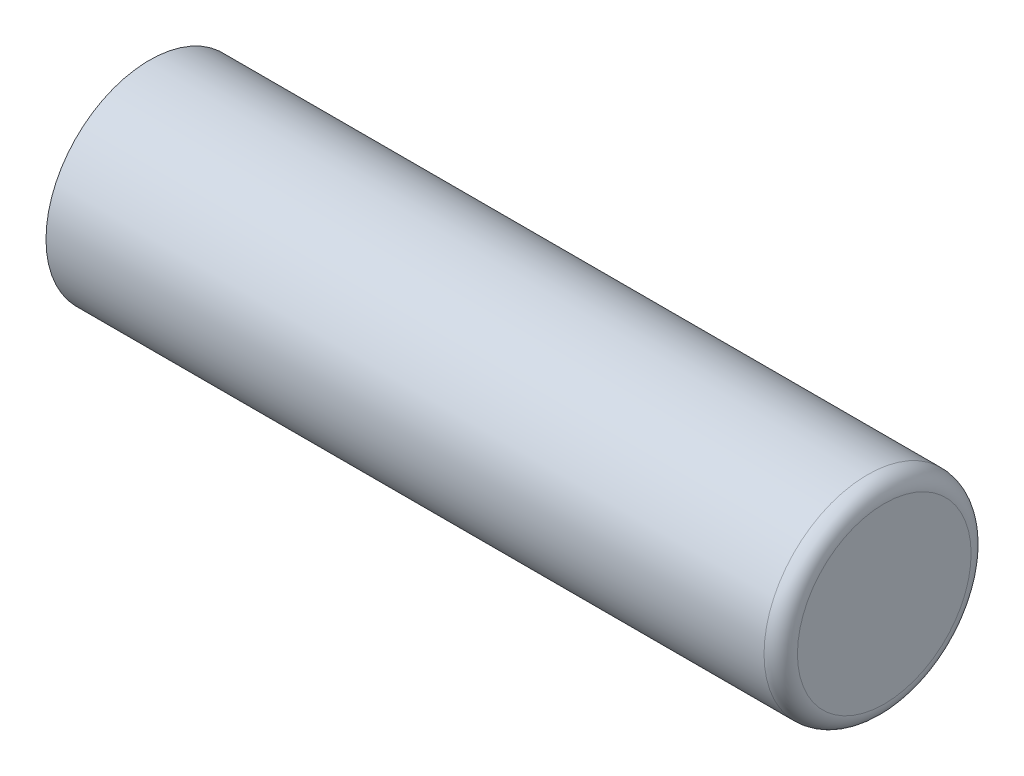
ISO-10303-21;
HEADER;
FILE_DESCRIPTION(('STEP AP214'),'2;1');
FILE_NAME('part.step','',(''),(''),'','','');
FILE_SCHEMA(('AUTOMOTIVE_DESIGN { 1 0 10303 214 1 1 1 1 }'));
ENDSEC;
DATA;
#1=APPLICATION_CONTEXT('core data for automotive mechanical design processes');
#2=APPLICATION_PROTOCOL_DEFINITION('international standard','automotive_design',2000,#1);
#3=PRODUCT_CONTEXT('',#1,'mechanical');
#4=PRODUCT('Part','Part','',(#3));
#5=PRODUCT_RELATED_PRODUCT_CATEGORY('part','',(#4));
#6=PRODUCT_DEFINITION_FORMATION('','',#4);
#7=PRODUCT_DEFINITION_CONTEXT('part definition',#1,'design');
#8=PRODUCT_DEFINITION('design','',#6,#7);
#9=PRODUCT_DEFINITION_SHAPE('','',#8);
#10=(LENGTH_UNIT() NAMED_UNIT(*) SI_UNIT(.MILLI.,.METRE.));
#11=(NAMED_UNIT(*) PLANE_ANGLE_UNIT() SI_UNIT($,.RADIAN.));
#12=(NAMED_UNIT(*) SI_UNIT($,.STERADIAN.) SOLID_ANGLE_UNIT());
#13=UNCERTAINTY_MEASURE_WITH_UNIT(LENGTH_MEASURE(1.E-05),#10,'distance_accuracy_value','');
#14=(GEOMETRIC_REPRESENTATION_CONTEXT(3) GLOBAL_UNCERTAINTY_ASSIGNED_CONTEXT((#13)) GLOBAL_UNIT_ASSIGNED_CONTEXT((#10,
#11,#12)) REPRESENTATION_CONTEXT('',''));
#15=CARTESIAN_POINT('',(0.,0.,0.));
#16=DIRECTION('',(0.,0.,1.));
#17=DIRECTION('',(1.,0.,0.));
#18=AXIS2_PLACEMENT_3D('',#15,#16,#17);
#19=CARTESIAN_POINT('',(11.,0.,-2.60000000000001));
#20=DIRECTION('',(-1.,0.,0.));
#21=DIRECTION('',(0.,0.,1.));
#22=AXIS2_PLACEMENT_3D('',#19,#20,#21);
#23=PLANE('',#22);
#24=CARTESIAN_POINT('',(11.,0.,0.));
#25=DIRECTION('',(-1.,0.,0.));
#26=DIRECTION('',(0.,0.,1.));
#27=AXIS2_PLACEMENT_3D('',#24,#25,#26);
#28=CIRCLE('',#27,2.60000000000001);
#29=CARTESIAN_POINT('',(11.,0.,2.60000000000001));
#30=VERTEX_POINT('',#29);
#31=EDGE_CURVE('E50',#30,#30,#28,.T.);
#32=ORIENTED_EDGE('',*,*,#31,.F.);
#33=EDGE_LOOP('',(#32));
#34=FACE_BOUND('',#33,.T.);
#35=ADVANCED_FACE('F40',(#34),#23,.F.);
#36=CARTESIAN_POINT('',(-11.,0.,-3.10000000000001));
#37=DIRECTION('',(1.,0.,0.));
#38=DIRECTION('',(0.,0.,-1.));
#39=AXIS2_PLACEMENT_3D('',#36,#37,#38);
#40=PLANE('',#39);
#41=CARTESIAN_POINT('',(-11.,0.,0.));
#42=DIRECTION('',(-1.,0.,0.));
#43=DIRECTION('',(0.,0.,1.));
#44=AXIS2_PLACEMENT_3D('',#41,#42,#43);
#45=CIRCLE('',#44,3.10000000000001);
#46=CARTESIAN_POINT('',(-11.,0.,3.10000000000001));
#47=VERTEX_POINT('',#46);
#48=EDGE_CURVE('E12',#47,#47,#45,.T.);
#49=ORIENTED_EDGE('',*,*,#48,.T.);
#50=EDGE_LOOP('',(#49));
#51=FACE_BOUND('',#50,.T.);
#52=ADVANCED_FACE('F60',(#51),#40,.F.);
#53=CARTESIAN_POINT('',(-11.,0.,0.));
#54=DIRECTION('',(-1.,0.,0.));
#55=DIRECTION('',(0.,0.,1.));
#56=AXIS2_PLACEMENT_3D('',#53,#54,#55);
#57=CYLINDRICAL_SURFACE('',#56,3.10000000000001);
#58=ORIENTED_EDGE('',*,*,#48,.F.);
#59=EDGE_LOOP('',(#58));
#60=FACE_BOUND('',#59,.T.);
#61=CARTESIAN_POINT('',(10.5,0.,0.));
#62=DIRECTION('',(-1.,0.,0.));
#63=DIRECTION('',(0.,0.,1.));
#64=AXIS2_PLACEMENT_3D('',#61,#62,#63);
#65=CIRCLE('',#64,3.10000000000001);
#66=CARTESIAN_POINT('',(10.5,0.,3.10000000000001));
#67=VERTEX_POINT('',#66);
#68=EDGE_CURVE('E46',#67,#67,#65,.T.);
#69=ORIENTED_EDGE('',*,*,#68,.T.);
#70=EDGE_LOOP('',(#69));
#71=FACE_BOUND('',#70,.T.);
#72=ADVANCED_FACE('F64',(#60,#71),#57,.T.);
#73=CARTESIAN_POINT('',(10.5,0.,0.));
#74=DIRECTION('',(-1.,0.,0.));
#75=DIRECTION('',(0.,0.,1.));
#76=AXIS2_PLACEMENT_3D('',#73,#74,#75);
#77=TOROIDAL_SURFACE('',#76,2.60000000000001,0.5);
#78=ORIENTED_EDGE('',*,*,#68,.F.);
#79=EDGE_LOOP('',(#78));
#80=FACE_BOUND('',#79,.T.);
#81=ORIENTED_EDGE('',*,*,#31,.T.);
#82=EDGE_LOOP('',(#81));
#83=FACE_BOUND('',#82,.T.);
#84=ADVANCED_FACE('F57',(#80,#83),#77,.T.);
#85=CLOSED_SHELL('',(#35,#52,#72,#84));
#86=MANIFOLD_SOLID_BREP('B2',#85);
#87=ADVANCED_BREP_SHAPE_REPRESENTATION('',(#18,#86),#14);
#88=SHAPE_DEFINITION_REPRESENTATION(#9,#87);
ENDSEC;
END-ISO-10303-21;
